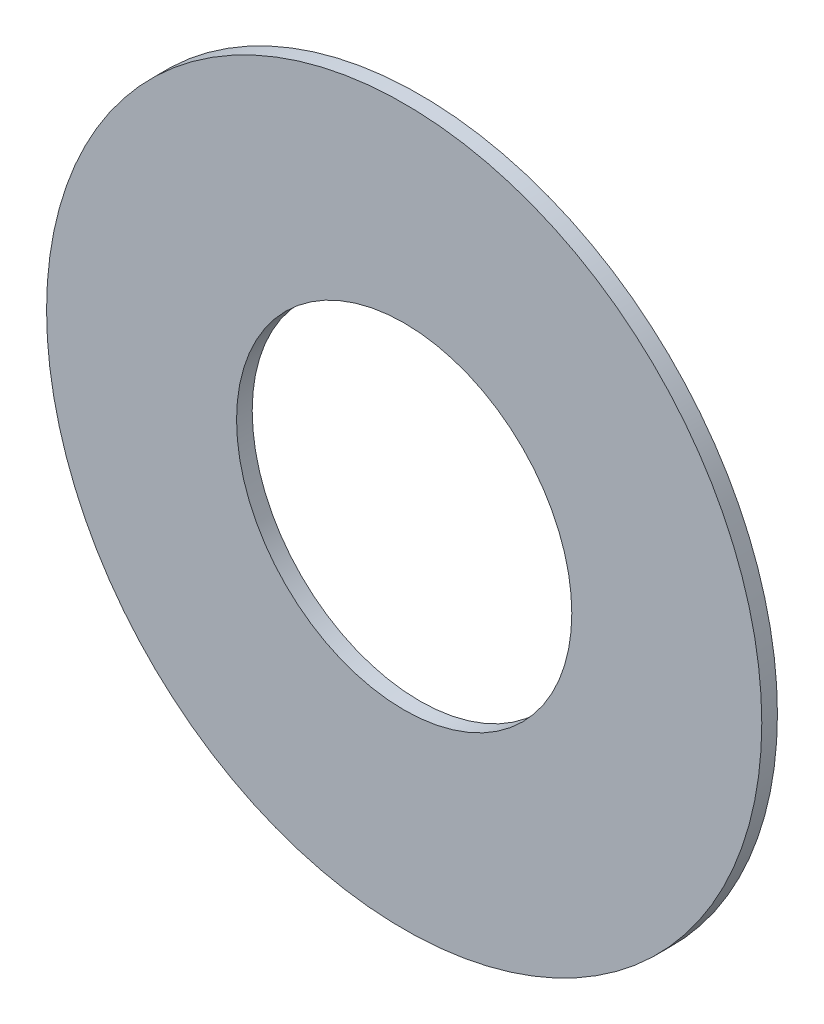
ISO-10303-21;
HEADER;
FILE_DESCRIPTION(('STEP AP214'),'2;1');
FILE_NAME('part.step','',(''),(''),'','','');
FILE_SCHEMA(('AUTOMOTIVE_DESIGN { 1 0 10303 214 1 1 1 1 }'));
ENDSEC;
DATA;
#1=APPLICATION_CONTEXT('core data for automotive mechanical design processes');
#2=APPLICATION_PROTOCOL_DEFINITION('international standard','automotive_design',2000,#1);
#3=PRODUCT_CONTEXT('',#1,'mechanical');
#4=PRODUCT('Part','Part','',(#3));
#5=PRODUCT_RELATED_PRODUCT_CATEGORY('part','',(#4));
#6=PRODUCT_DEFINITION_FORMATION('','',#4);
#7=PRODUCT_DEFINITION_CONTEXT('part definition',#1,'design');
#8=PRODUCT_DEFINITION('design','',#6,#7);
#9=PRODUCT_DEFINITION_SHAPE('','',#8);
#10=(LENGTH_UNIT() NAMED_UNIT(*) SI_UNIT(.MILLI.,.METRE.));
#11=(NAMED_UNIT(*) PLANE_ANGLE_UNIT() SI_UNIT($,.RADIAN.));
#12=(NAMED_UNIT(*) SI_UNIT($,.STERADIAN.) SOLID_ANGLE_UNIT());
#13=UNCERTAINTY_MEASURE_WITH_UNIT(LENGTH_MEASURE(1.E-05),#10,'distance_accuracy_value','');
#14=(GEOMETRIC_REPRESENTATION_CONTEXT(3) GLOBAL_UNCERTAINTY_ASSIGNED_CONTEXT((#13)) GLOBAL_UNIT_ASSIGNED_CONTEXT((#10,
#11,#12)) REPRESENTATION_CONTEXT('',''));
#15=CARTESIAN_POINT('',(0.,0.,0.));
#16=DIRECTION('',(0.,0.,1.));
#17=DIRECTION('',(1.,0.,0.));
#18=AXIS2_PLACEMENT_3D('',#15,#16,#17);
#19=CARTESIAN_POINT('',(155.448,-76.2,-0.045));
#20=DIRECTION('',(0.,0.,-1.));
#21=DIRECTION('',(0.,-1.,0.));
#22=AXIS2_PLACEMENT_3D('',#19,#20,#21);
#23=CYLINDRICAL_SURFACE('',#22,0.375);
#24=CARTESIAN_POINT('',(155.448,-76.2,1.67));
#25=DIRECTION('',(0.,0.,-1.));
#26=DIRECTION('',(0.,-1.,0.));
#27=AXIS2_PLACEMENT_3D('',#24,#25,#26);
#28=CIRCLE('',#27,0.375);
#29=CARTESIAN_POINT('',(155.448,-76.575,1.67));
#30=VERTEX_POINT('',#29);
#31=EDGE_CURVE('E26',#30,#30,#28,.T.);
#32=ORIENTED_EDGE('',*,*,#31,.T.);
#33=DIRECTION('',(0.,0.,1.));
#34=VECTOR('',#33,1.);
#35=CARTESIAN_POINT('',(155.448,-76.575,-0.045));
#36=LINE('',#35,#34);
#37=CARTESIAN_POINT('',(155.448,-76.575,1.705));
#38=VERTEX_POINT('',#37);
#39=EDGE_CURVE('E11',#30,#38,#36,.T.);
#40=ORIENTED_EDGE('',*,*,#39,.T.);
#41=CARTESIAN_POINT('',(155.448,-76.2,1.705));
#42=DIRECTION('',(0.,0.,-1.));
#43=DIRECTION('',(0.,-1.,0.));
#44=AXIS2_PLACEMENT_3D('',#41,#42,#43);
#45=CIRCLE('',#44,0.375);
#46=EDGE_CURVE('E20',#38,#38,#45,.T.);
#47=ORIENTED_EDGE('',*,*,#46,.F.);
#48=ORIENTED_EDGE('',*,*,#39,.F.);
#49=EDGE_LOOP('',(#32,#40,#47,#48));
#50=FACE_BOUND('',#49,.T.);
#51=ADVANCED_FACE('F17',(#50),#23,.F.);
#52=CARTESIAN_POINT('',(155.448,-76.2,1.67));
#53=DIRECTION('',(0.,0.,1.));
#54=DIRECTION('',(1.,0.,0.));
#55=AXIS2_PLACEMENT_3D('',#52,#53,#54);
#56=PLANE('',#55);
#57=ORIENTED_EDGE('',*,*,#31,.F.);
#58=EDGE_LOOP('',(#57));
#59=FACE_BOUND('',#58,.T.);
#60=CARTESIAN_POINT('',(155.448,-76.2,1.67));
#61=DIRECTION('',(0.,0.,1.));
#62=DIRECTION('',(1.,0.,0.));
#63=AXIS2_PLACEMENT_3D('',#60,#61,#62);
#64=CIRCLE('',#63,0.8);
#65=CARTESIAN_POINT('',(156.248,-76.2,1.67));
#66=VERTEX_POINT('',#65);
#67=EDGE_CURVE('E58',#66,#66,#64,.T.);
#68=ORIENTED_EDGE('',*,*,#67,.F.);
#69=EDGE_LOOP('',(#68));
#70=FACE_BOUND('',#69,.T.);
#71=ADVANCED_FACE('F79',(#59,#70),#56,.F.);
#72=CARTESIAN_POINT('',(155.448,-76.2,1.705));
#73=DIRECTION('',(0.,0.,1.));
#74=DIRECTION('',(1.,0.,0.));
#75=AXIS2_PLACEMENT_3D('',#72,#73,#74);
#76=PLANE('',#75);
#77=ORIENTED_EDGE('',*,*,#46,.T.);
#78=EDGE_LOOP('',(#77));
#79=FACE_BOUND('',#78,.T.);
#80=CARTESIAN_POINT('',(155.448,-76.2,1.705));
#81=DIRECTION('',(0.,0.,1.));
#82=DIRECTION('',(1.,0.,0.));
#83=AXIS2_PLACEMENT_3D('',#80,#81,#82);
#84=CIRCLE('',#83,0.8);
#85=CARTESIAN_POINT('',(156.248,-76.2,1.705));
#86=VERTEX_POINT('',#85);
#87=EDGE_CURVE('E56',#86,#86,#84,.T.);
#88=ORIENTED_EDGE('',*,*,#87,.T.);
#89=EDGE_LOOP('',(#88));
#90=FACE_BOUND('',#89,.T.);
#91=ADVANCED_FACE('F62',(#79,#90),#76,.T.);
#92=CARTESIAN_POINT('',(155.448,-76.2,1.67));
#93=DIRECTION('',(0.,0.,1.));
#94=DIRECTION('',(1.,0.,0.));
#95=AXIS2_PLACEMENT_3D('',#92,#93,#94);
#96=CYLINDRICAL_SURFACE('',#95,0.8);
#97=ORIENTED_EDGE('',*,*,#87,.F.);
#98=DIRECTION('',(0.,0.,1.));
#99=VECTOR('',#98,1.);
#100=CARTESIAN_POINT('',(156.248,-76.2,1.67));
#101=LINE('',#100,#99);
#102=EDGE_CURVE('E53',#66,#86,#101,.T.);
#103=ORIENTED_EDGE('',*,*,#102,.F.);
#104=ORIENTED_EDGE('',*,*,#67,.T.);
#105=ORIENTED_EDGE('',*,*,#102,.T.);
#106=EDGE_LOOP('',(#97,#103,#104,#105));
#107=FACE_BOUND('',#106,.T.);
#108=ADVANCED_FACE('F55',(#107),#96,.T.);
#109=CLOSED_SHELL('',(#51,#71,#91,#108));
#110=MANIFOLD_SOLID_BREP('B1',#109);
#111=ADVANCED_BREP_SHAPE_REPRESENTATION('',(#18,#110),#14);
#112=SHAPE_DEFINITION_REPRESENTATION(#9,#111);
ENDSEC;
END-ISO-10303-21;
